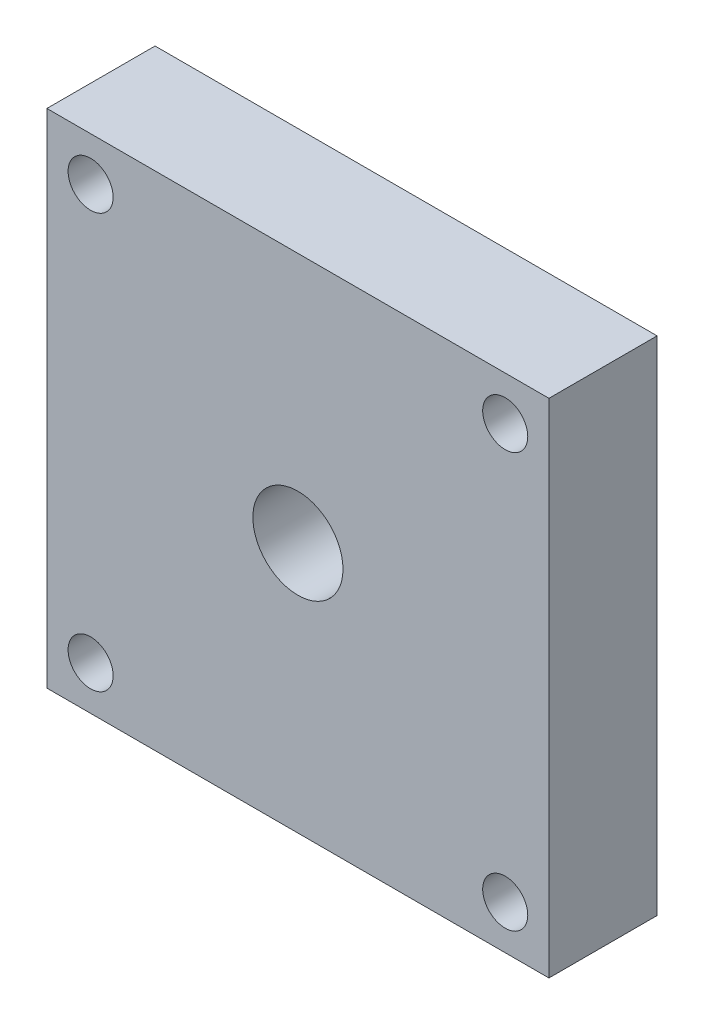
ISO-10303-21;
HEADER;
FILE_DESCRIPTION(('STEP AP214'),'2;1');
FILE_NAME('part.step','',(''),(''),'','','');
FILE_SCHEMA(('AUTOMOTIVE_DESIGN { 1 0 10303 214 1 1 1 1 }'));
ENDSEC;
DATA;
#1=APPLICATION_CONTEXT('core data for automotive mechanical design processes');
#2=APPLICATION_PROTOCOL_DEFINITION('international standard','automotive_design',2000,#1);
#3=PRODUCT_CONTEXT('',#1,'mechanical');
#4=PRODUCT('Part','Part','',(#3));
#5=PRODUCT_RELATED_PRODUCT_CATEGORY('part','',(#4));
#6=PRODUCT_DEFINITION_FORMATION('','',#4);
#7=PRODUCT_DEFINITION_CONTEXT('part definition',#1,'design');
#8=PRODUCT_DEFINITION('design','',#6,#7);
#9=PRODUCT_DEFINITION_SHAPE('','',#8);
#10=(LENGTH_UNIT() NAMED_UNIT(*) SI_UNIT(.MILLI.,.METRE.));
#11=(NAMED_UNIT(*) PLANE_ANGLE_UNIT() SI_UNIT($,.RADIAN.));
#12=(NAMED_UNIT(*) SI_UNIT($,.STERADIAN.) SOLID_ANGLE_UNIT());
#13=UNCERTAINTY_MEASURE_WITH_UNIT(LENGTH_MEASURE(1.E-05),#10,'distance_accuracy_value','');
#14=(GEOMETRIC_REPRESENTATION_CONTEXT(3) GLOBAL_UNCERTAINTY_ASSIGNED_CONTEXT((#13)) GLOBAL_UNIT_ASSIGNED_CONTEXT((#10,
#11,#12)) REPRESENTATION_CONTEXT('',''));
#15=CARTESIAN_POINT('',(0.,0.,0.));
#16=DIRECTION('',(0.,0.,1.));
#17=DIRECTION('',(1.,0.,0.));
#18=AXIS2_PLACEMENT_3D('',#15,#16,#17);
#19=CARTESIAN_POINT('',(0.,0.,6.));
#20=DIRECTION('',(0.,0.,1.));
#21=DIRECTION('',(1.,0.,0.));
#22=AXIS2_PLACEMENT_3D('',#19,#20,#21);
#23=PLANE('',#22);
#24=CARTESIAN_POINT('',(12.5357438016529,-13.796652892562,6.));
#25=DIRECTION('',(0.,0.,1.));
#26=DIRECTION('',(1.,0.,0.));
#27=AXIS2_PLACEMENT_3D('',#24,#25,#26);
#28=CIRCLE('',#27,1.25);
#29=CARTESIAN_POINT('',(13.7857438016529,-13.796652892562,6.));
#30=VERTEX_POINT('',#29);
#31=EDGE_CURVE('E126',#30,#30,#28,.T.);
#32=ORIENTED_EDGE('',*,*,#31,.F.);
#33=EDGE_LOOP('',(#32));
#34=FACE_BOUND('',#33,.T.);
#35=CARTESIAN_POINT('',(-10.4642561983471,9.19334710743802,6.));
#36=DIRECTION('',(0.,0.,1.));
#37=DIRECTION('',(1.,0.,0.));
#38=AXIS2_PLACEMENT_3D('',#35,#36,#37);
#39=CIRCLE('',#38,1.25);
#40=CARTESIAN_POINT('',(-9.21425619834711,9.19334710743802,6.));
#41=VERTEX_POINT('',#40);
#42=EDGE_CURVE('E114',#41,#41,#39,.T.);
#43=ORIENTED_EDGE('',*,*,#42,.F.);
#44=EDGE_LOOP('',(#43));
#45=FACE_BOUND('',#44,.T.);
#46=DIRECTION('',(0.,-1.,0.));
#47=VECTOR('',#46,1.);
#48=CARTESIAN_POINT('',(-12.8892561983471,11.623347107438,6.));
#49=LINE('',#48,#47);
#50=CARTESIAN_POINT('',(-12.8892561983471,11.623347107438,6.));
#51=VERTEX_POINT('',#50);
#52=CARTESIAN_POINT('',(-12.8892561983471,-16.226652892562,6.));
#53=VERTEX_POINT('',#52);
#54=EDGE_CURVE('E84',#51,#53,#49,.T.);
#55=ORIENTED_EDGE('',*,*,#54,.T.);
#56=DIRECTION('',(1.,0.,0.));
#57=VECTOR('',#56,1.);
#58=CARTESIAN_POINT('',(-12.8892561983471,-16.226652892562,6.));
#59=LINE('',#58,#57);
#60=CARTESIAN_POINT('',(14.9607438016529,-16.226652892562,6.));
#61=VERTEX_POINT('',#60);
#62=EDGE_CURVE('E79',#53,#61,#59,.T.);
#63=ORIENTED_EDGE('',*,*,#62,.T.);
#64=DIRECTION('',(0.,1.,0.));
#65=VECTOR('',#64,1.);
#66=CARTESIAN_POINT('',(14.9607438016529,11.623347107438,6.));
#67=LINE('',#66,#65);
#68=CARTESIAN_POINT('',(14.9607438016529,11.623347107438,6.));
#69=VERTEX_POINT('',#68);
#70=EDGE_CURVE('E82',#61,#69,#67,.T.);
#71=ORIENTED_EDGE('',*,*,#70,.T.);
#72=DIRECTION('',(-1.,0.,0.));
#73=VECTOR('',#72,1.);
#74=CARTESIAN_POINT('',(-12.8892561983471,11.623347107438,6.));
#75=LINE('',#74,#73);
#76=EDGE_CURVE('E49',#69,#51,#75,.T.);
#77=ORIENTED_EDGE('',*,*,#76,.T.);
#78=EDGE_LOOP('',(#55,#63,#71,#77));
#79=FACE_BOUND('',#78,.T.);
#80=CARTESIAN_POINT('',(12.5357438016529,9.19334710743802,6.));
#81=DIRECTION('',(0.,0.,1.));
#82=DIRECTION('',(1.,0.,0.));
#83=AXIS2_PLACEMENT_3D('',#80,#81,#82);
#84=CIRCLE('',#83,1.25);
#85=CARTESIAN_POINT('',(13.7857438016529,9.19334710743802,6.));
#86=VERTEX_POINT('',#85);
#87=EDGE_CURVE('E99',#86,#86,#84,.T.);
#88=ORIENTED_EDGE('',*,*,#87,.F.);
#89=EDGE_LOOP('',(#88));
#90=FACE_BOUND('',#89,.T.);
#91=CARTESIAN_POINT('',(-10.4642561983471,-13.796652892562,6.));
#92=DIRECTION('',(0.,0.,1.));
#93=DIRECTION('',(1.,0.,0.));
#94=AXIS2_PLACEMENT_3D('',#91,#92,#93);
#95=CIRCLE('',#94,1.25);
#96=CARTESIAN_POINT('',(-9.21425619834711,-13.796652892562,6.));
#97=VERTEX_POINT('',#96);
#98=EDGE_CURVE('E120',#97,#97,#95,.T.);
#99=ORIENTED_EDGE('',*,*,#98,.F.);
#100=EDGE_LOOP('',(#99));
#101=FACE_BOUND('',#100,.T.);
#102=CARTESIAN_POINT('',(1.03574380165289,-2.30165289256198,6.));
#103=DIRECTION('',(0.,0.,1.));
#104=DIRECTION('',(1.,0.,0.));
#105=AXIS2_PLACEMENT_3D('',#102,#103,#104);
#106=CIRCLE('',#105,2.5);
#107=CARTESIAN_POINT('',(3.53574380165289,-2.30165289256198,6.));
#108=VERTEX_POINT('',#107);
#109=EDGE_CURVE('E132',#108,#108,#106,.T.);
#110=ORIENTED_EDGE('',*,*,#109,.F.);
#111=EDGE_LOOP('',(#110));
#112=FACE_BOUND('',#111,.T.);
#113=ADVANCED_FACE('F32',(#34,#45,#79,#90,#101,#112),#23,.T.);
#114=CARTESIAN_POINT('',(0.,0.,0.));
#115=DIRECTION('',(0.,0.,1.));
#116=DIRECTION('',(1.,0.,0.));
#117=AXIS2_PLACEMENT_3D('',#114,#115,#116);
#118=PLANE('',#117);
#119=DIRECTION('',(0.,-1.,0.));
#120=VECTOR('',#119,1.);
#121=CARTESIAN_POINT('',(-12.8892561983471,11.623347107438,0.));
#122=LINE('',#121,#120);
#123=CARTESIAN_POINT('',(-12.8892561983471,11.623347107438,0.));
#124=VERTEX_POINT('',#123);
#125=CARTESIAN_POINT('',(-12.8892561983471,-16.226652892562,0.));
#126=VERTEX_POINT('',#125);
#127=EDGE_CURVE('E96',#124,#126,#122,.T.);
#128=ORIENTED_EDGE('',*,*,#127,.F.);
#129=DIRECTION('',(-1.,0.,0.));
#130=VECTOR('',#129,1.);
#131=CARTESIAN_POINT('',(-12.8892561983471,11.623347107438,0.));
#132=LINE('',#131,#130);
#133=CARTESIAN_POINT('',(14.9607438016529,11.623347107438,0.));
#134=VERTEX_POINT('',#133);
#135=EDGE_CURVE('E72',#134,#124,#132,.T.);
#136=ORIENTED_EDGE('',*,*,#135,.F.);
#137=DIRECTION('',(0.,1.,0.));
#138=VECTOR('',#137,1.);
#139=CARTESIAN_POINT('',(14.9607438016529,11.623347107438,0.));
#140=LINE('',#139,#138);
#141=CARTESIAN_POINT('',(14.9607438016529,-16.226652892562,0.));
#142=VERTEX_POINT('',#141);
#143=EDGE_CURVE('E66',#142,#134,#140,.T.);
#144=ORIENTED_EDGE('',*,*,#143,.F.);
#145=DIRECTION('',(1.,0.,0.));
#146=VECTOR('',#145,1.);
#147=CARTESIAN_POINT('',(-12.8892561983471,-16.226652892562,0.));
#148=LINE('',#147,#146);
#149=EDGE_CURVE('E88',#126,#142,#148,.T.);
#150=ORIENTED_EDGE('',*,*,#149,.F.);
#151=EDGE_LOOP('',(#128,#136,#144,#150));
#152=FACE_BOUND('',#151,.T.);
#153=CARTESIAN_POINT('',(12.5357438016529,9.19334710743802,0.));
#154=DIRECTION('',(0.,0.,1.));
#155=DIRECTION('',(1.,0.,0.));
#156=AXIS2_PLACEMENT_3D('',#153,#154,#155);
#157=CIRCLE('',#156,1.25);
#158=CARTESIAN_POINT('',(13.7857438016529,9.19334710743802,0.));
#159=VERTEX_POINT('',#158);
#160=EDGE_CURVE('E111',#159,#159,#157,.T.);
#161=ORIENTED_EDGE('',*,*,#160,.T.);
#162=EDGE_LOOP('',(#161));
#163=FACE_BOUND('',#162,.T.);
#164=CARTESIAN_POINT('',(-10.4642561983471,9.19334710743802,0.));
#165=DIRECTION('',(0.,0.,1.));
#166=DIRECTION('',(1.,0.,0.));
#167=AXIS2_PLACEMENT_3D('',#164,#165,#166);
#168=CIRCLE('',#167,1.25);
#169=CARTESIAN_POINT('',(-9.21425619834711,9.19334710743802,0.));
#170=VERTEX_POINT('',#169);
#171=EDGE_CURVE('E117',#170,#170,#168,.T.);
#172=ORIENTED_EDGE('',*,*,#171,.T.);
#173=EDGE_LOOP('',(#172));
#174=FACE_BOUND('',#173,.T.);
#175=CARTESIAN_POINT('',(-10.4642561983471,-13.796652892562,0.));
#176=DIRECTION('',(0.,0.,1.));
#177=DIRECTION('',(1.,0.,0.));
#178=AXIS2_PLACEMENT_3D('',#175,#176,#177);
#179=CIRCLE('',#178,1.25);
#180=CARTESIAN_POINT('',(-9.21425619834711,-13.796652892562,0.));
#181=VERTEX_POINT('',#180);
#182=EDGE_CURVE('E123',#181,#181,#179,.T.);
#183=ORIENTED_EDGE('',*,*,#182,.T.);
#184=EDGE_LOOP('',(#183));
#185=FACE_BOUND('',#184,.T.);
#186=CARTESIAN_POINT('',(12.5357438016529,-13.796652892562,0.));
#187=DIRECTION('',(0.,0.,1.));
#188=DIRECTION('',(1.,0.,0.));
#189=AXIS2_PLACEMENT_3D('',#186,#187,#188);
#190=CIRCLE('',#189,1.25);
#191=CARTESIAN_POINT('',(13.7857438016529,-13.796652892562,0.));
#192=VERTEX_POINT('',#191);
#193=EDGE_CURVE('E129',#192,#192,#190,.T.);
#194=ORIENTED_EDGE('',*,*,#193,.T.);
#195=EDGE_LOOP('',(#194));
#196=FACE_BOUND('',#195,.T.);
#197=CARTESIAN_POINT('',(1.03574380165289,-2.30165289256198,0.));
#198=DIRECTION('',(0.,0.,1.));
#199=DIRECTION('',(1.,0.,0.));
#200=AXIS2_PLACEMENT_3D('',#197,#198,#199);
#201=CIRCLE('',#200,2.5);
#202=CARTESIAN_POINT('',(3.53574380165289,-2.30165289256198,0.));
#203=VERTEX_POINT('',#202);
#204=EDGE_CURVE('E135',#203,#203,#201,.T.);
#205=ORIENTED_EDGE('',*,*,#204,.T.);
#206=EDGE_LOOP('',(#205));
#207=FACE_BOUND('',#206,.T.);
#208=ADVANCED_FACE('F107',(#152,#163,#174,#185,#196,#207),#118,.F.);
#209=CARTESIAN_POINT('',(-12.8892561983471,11.623347107438,6.));
#210=DIRECTION('',(1.,0.,0.));
#211=DIRECTION('',(0.,1.,0.));
#212=AXIS2_PLACEMENT_3D('',#209,#210,#211);
#213=PLANE('',#212);
#214=ORIENTED_EDGE('',*,*,#127,.T.);
#215=DIRECTION('',(0.,0.,-1.));
#216=VECTOR('',#215,1.);
#217=CARTESIAN_POINT('',(-12.8892561983471,-16.226652892562,6.));
#218=LINE('',#217,#216);
#219=EDGE_CURVE('E11',#53,#126,#218,.T.);
#220=ORIENTED_EDGE('',*,*,#219,.F.);
#221=ORIENTED_EDGE('',*,*,#54,.F.);
#222=DIRECTION('',(0.,0.,-1.));
#223=VECTOR('',#222,1.);
#224=CARTESIAN_POINT('',(-12.8892561983471,11.623347107438,6.));
#225=LINE('',#224,#223);
#226=EDGE_CURVE('E92',#51,#124,#225,.T.);
#227=ORIENTED_EDGE('',*,*,#226,.T.);
#228=EDGE_LOOP('',(#214,#220,#221,#227));
#229=FACE_BOUND('',#228,.T.);
#230=ADVANCED_FACE('F34',(#229),#213,.F.);
#231=CARTESIAN_POINT('',(-12.8892561983471,-16.226652892562,6.));
#232=DIRECTION('',(0.,1.,0.));
#233=DIRECTION('',(0.,0.,1.));
#234=AXIS2_PLACEMENT_3D('',#231,#232,#233);
#235=PLANE('',#234);
#236=ORIENTED_EDGE('',*,*,#149,.T.);
#237=DIRECTION('',(0.,0.,-1.));
#238=VECTOR('',#237,1.);
#239=CARTESIAN_POINT('',(14.9607438016529,-16.226652892562,6.));
#240=LINE('',#239,#238);
#241=EDGE_CURVE('E41',#61,#142,#240,.T.);
#242=ORIENTED_EDGE('',*,*,#241,.F.);
#243=ORIENTED_EDGE('',*,*,#62,.F.);
#244=ORIENTED_EDGE('',*,*,#219,.T.);
#245=EDGE_LOOP('',(#236,#242,#243,#244));
#246=FACE_BOUND('',#245,.T.);
#247=ADVANCED_FACE('F87',(#246),#235,.F.);
#248=CARTESIAN_POINT('',(14.9607438016529,11.623347107438,6.));
#249=DIRECTION('',(-1.,0.,0.));
#250=DIRECTION('',(0.,-1.,0.));
#251=AXIS2_PLACEMENT_3D('',#248,#249,#250);
#252=PLANE('',#251);
#253=ORIENTED_EDGE('',*,*,#143,.T.);
#254=DIRECTION('',(0.,0.,-1.));
#255=VECTOR('',#254,1.);
#256=CARTESIAN_POINT('',(14.9607438016529,11.623347107438,6.));
#257=LINE('',#256,#255);
#258=EDGE_CURVE('E89',#69,#134,#257,.T.);
#259=ORIENTED_EDGE('',*,*,#258,.F.);
#260=ORIENTED_EDGE('',*,*,#70,.F.);
#261=ORIENTED_EDGE('',*,*,#241,.T.);
#262=EDGE_LOOP('',(#253,#259,#260,#261));
#263=FACE_BOUND('',#262,.T.);
#264=ADVANCED_FACE('F90',(#263),#252,.F.);
#265=CARTESIAN_POINT('',(-12.8892561983471,11.623347107438,6.));
#266=DIRECTION('',(0.,-1.,0.));
#267=DIRECTION('',(0.,0.,-1.));
#268=AXIS2_PLACEMENT_3D('',#265,#266,#267);
#269=PLANE('',#268);
#270=ORIENTED_EDGE('',*,*,#135,.T.);
#271=ORIENTED_EDGE('',*,*,#226,.F.);
#272=ORIENTED_EDGE('',*,*,#76,.F.);
#273=ORIENTED_EDGE('',*,*,#258,.T.);
#274=EDGE_LOOP('',(#270,#271,#272,#273));
#275=FACE_BOUND('',#274,.T.);
#276=ADVANCED_FACE('F104',(#275),#269,.F.);
#277=CARTESIAN_POINT('',(12.5357438016529,9.19334710743802,6.));
#278=DIRECTION('',(0.,0.,-1.));
#279=DIRECTION('',(-1.,0.,0.));
#280=AXIS2_PLACEMENT_3D('',#277,#278,#279);
#281=CYLINDRICAL_SURFACE('',#280,1.25);
#282=ORIENTED_EDGE('',*,*,#87,.T.);
#283=EDGE_LOOP('',(#282));
#284=FACE_BOUND('',#283,.T.);
#285=ORIENTED_EDGE('',*,*,#160,.F.);
#286=EDGE_LOOP('',(#285));
#287=FACE_BOUND('',#286,.T.);
#288=ADVANCED_FACE('F154',(#284,#287),#281,.F.);
#289=CARTESIAN_POINT('',(-10.4642561983471,9.19334710743802,6.));
#290=DIRECTION('',(0.,0.,-1.));
#291=DIRECTION('',(-1.,0.,0.));
#292=AXIS2_PLACEMENT_3D('',#289,#290,#291);
#293=CYLINDRICAL_SURFACE('',#292,1.25);
#294=ORIENTED_EDGE('',*,*,#42,.T.);
#295=EDGE_LOOP('',(#294));
#296=FACE_BOUND('',#295,.T.);
#297=ORIENTED_EDGE('',*,*,#171,.F.);
#298=EDGE_LOOP('',(#297));
#299=FACE_BOUND('',#298,.T.);
#300=ADVANCED_FACE('F200',(#296,#299),#293,.F.);
#301=CARTESIAN_POINT('',(-10.4642561983471,-13.796652892562,6.));
#302=DIRECTION('',(0.,0.,-1.));
#303=DIRECTION('',(-1.,0.,0.));
#304=AXIS2_PLACEMENT_3D('',#301,#302,#303);
#305=CYLINDRICAL_SURFACE('',#304,1.25);
#306=ORIENTED_EDGE('',*,*,#98,.T.);
#307=EDGE_LOOP('',(#306));
#308=FACE_BOUND('',#307,.T.);
#309=ORIENTED_EDGE('',*,*,#182,.F.);
#310=EDGE_LOOP('',(#309));
#311=FACE_BOUND('',#310,.T.);
#312=ADVANCED_FACE('F208',(#308,#311),#305,.F.);
#313=CARTESIAN_POINT('',(12.5357438016529,-13.796652892562,6.));
#314=DIRECTION('',(0.,0.,-1.));
#315=DIRECTION('',(-1.,0.,0.));
#316=AXIS2_PLACEMENT_3D('',#313,#314,#315);
#317=CYLINDRICAL_SURFACE('',#316,1.25);
#318=ORIENTED_EDGE('',*,*,#31,.T.);
#319=EDGE_LOOP('',(#318));
#320=FACE_BOUND('',#319,.T.);
#321=ORIENTED_EDGE('',*,*,#193,.F.);
#322=EDGE_LOOP('',(#321));
#323=FACE_BOUND('',#322,.T.);
#324=ADVANCED_FACE('F216',(#320,#323),#317,.F.);
#325=CARTESIAN_POINT('',(1.03574380165289,-2.30165289256198,6.));
#326=DIRECTION('',(0.,0.,-1.));
#327=DIRECTION('',(-1.,0.,0.));
#328=AXIS2_PLACEMENT_3D('',#325,#326,#327);
#329=CYLINDRICAL_SURFACE('',#328,2.5);
#330=ORIENTED_EDGE('',*,*,#109,.T.);
#331=EDGE_LOOP('',(#330));
#332=FACE_BOUND('',#331,.T.);
#333=ORIENTED_EDGE('',*,*,#204,.F.);
#334=EDGE_LOOP('',(#333));
#335=FACE_BOUND('',#334,.T.);
#336=ADVANCED_FACE('F141',(#332,#335),#329,.F.);
#337=CLOSED_SHELL('',(#113,#208,#230,#247,#264,#276,#288,#300,#312,#324,#336));
#338=MANIFOLD_SOLID_BREP('B2',#337);
#339=ADVANCED_BREP_SHAPE_REPRESENTATION('',(#18,#338),#14);
#340=SHAPE_DEFINITION_REPRESENTATION(#9,#339);
ENDSEC;
END-ISO-10303-21;
